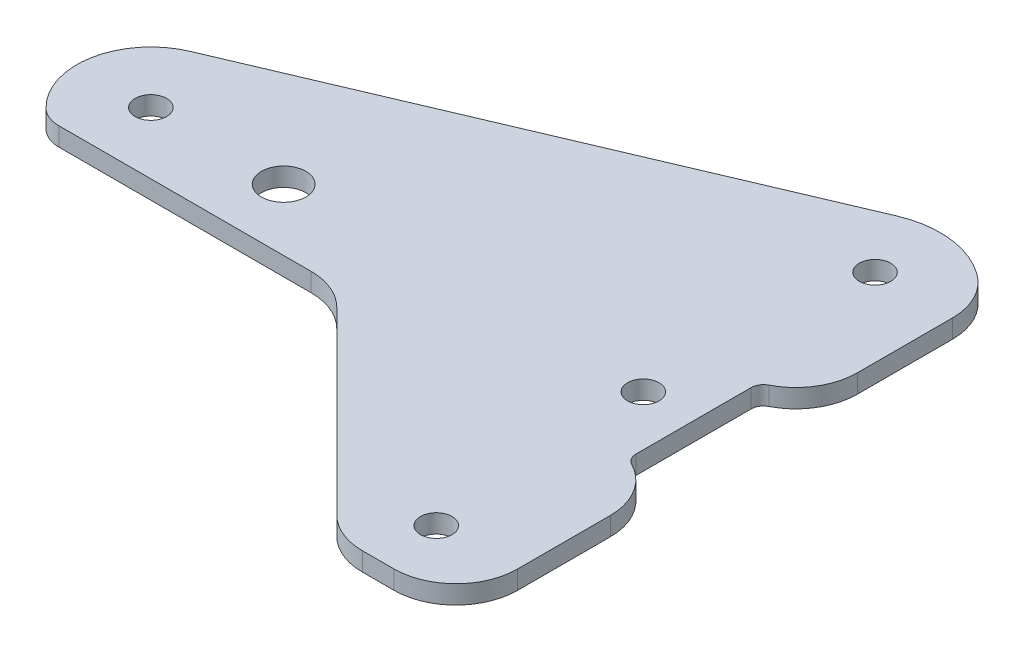
ISO-10303-21;
HEADER;
FILE_DESCRIPTION(('STEP AP214'),'2;1');
FILE_NAME('part.step','',(''),(''),'','','');
FILE_SCHEMA(('AUTOMOTIVE_DESIGN { 1 0 10303 214 1 1 1 1 }'));
ENDSEC;
DATA;
#1=APPLICATION_CONTEXT('core data for automotive mechanical design processes');
#2=APPLICATION_PROTOCOL_DEFINITION('international standard','automotive_design',2000,#1);
#3=PRODUCT_CONTEXT('',#1,'mechanical');
#4=PRODUCT('Part','Part','',(#3));
#5=PRODUCT_RELATED_PRODUCT_CATEGORY('part','',(#4));
#6=PRODUCT_DEFINITION_FORMATION('','',#4);
#7=PRODUCT_DEFINITION_CONTEXT('part definition',#1,'design');
#8=PRODUCT_DEFINITION('design','',#6,#7);
#9=PRODUCT_DEFINITION_SHAPE('','',#8);
#10=(LENGTH_UNIT() NAMED_UNIT(*) SI_UNIT(.MILLI.,.METRE.));
#11=(NAMED_UNIT(*) PLANE_ANGLE_UNIT() SI_UNIT($,.RADIAN.));
#12=(NAMED_UNIT(*) SI_UNIT($,.STERADIAN.) SOLID_ANGLE_UNIT());
#13=UNCERTAINTY_MEASURE_WITH_UNIT(LENGTH_MEASURE(1.E-05),#10,'distance_accuracy_value','');
#14=(GEOMETRIC_REPRESENTATION_CONTEXT(3) GLOBAL_UNCERTAINTY_ASSIGNED_CONTEXT((#13)) GLOBAL_UNIT_ASSIGNED_CONTEXT((#10,
#11,#12)) REPRESENTATION_CONTEXT('',''));
#15=CARTESIAN_POINT('',(0.,0.,0.));
#16=DIRECTION('',(0.,0.,1.));
#17=DIRECTION('',(1.,0.,0.));
#18=AXIS2_PLACEMENT_3D('',#15,#16,#17);
#19=CARTESIAN_POINT('',(243.548253692,70.6652182043,21.06693323164));
#20=DIRECTION('',(0.578405924452189,0.,-0.815749095346485));
#21=DIRECTION('',(-0.815749095346485,0.,-0.578405924452189));
#22=AXIS2_PLACEMENT_3D('',#19,#20,#21);
#23=PLANE('',#22);
#24=DIRECTION('',(0.,1.,0.));
#25=VECTOR('',#24,1.);
#26=CARTESIAN_POINT('',(218.489516869227,70.6652182043,3.29906573380305));
#27=LINE('',#26,#25);
#28=CARTESIAN_POINT('',(218.48951686925,70.6652182043,3.29906573382962));
#29=VERTEX_POINT('',#28);
#30=CARTESIAN_POINT('',(218.489516869488,67.6652182043,3.29906573399572));
#31=VERTEX_POINT('',#30);
#32=EDGE_CURVE('E301',#29,#31,#27,.F.);
#33=ORIENTED_EDGE('',*,*,#32,.F.);
#34=DIRECTION('',(-0.815749095346485,0.,-0.578405924452189));
#35=VECTOR('',#34,1.);
#36=CARTESIAN_POINT('',(243.548253692,70.6652182043,21.06693323164));
#37=LINE('',#36,#35);
#38=CARTESIAN_POINT('',(218.548253692011,70.6652182043,3.34071300805364));
#39=VERTEX_POINT('',#38);
#40=EDGE_CURVE('E196',#29,#39,#37,.F.);
#41=ORIENTED_EDGE('',*,*,#40,.T.);
#42=DIRECTION('',(0.,-1.,0.));
#43=VECTOR('',#42,1.);
#44=CARTESIAN_POINT('',(218.548253692006,70.6652182043,3.3407130080441));
#45=LINE('',#44,#43);
#46=CARTESIAN_POINT('',(218.54825369217,67.6652182043,3.3407130081649));
#47=VERTEX_POINT('',#46);
#48=EDGE_CURVE('E300',#47,#39,#45,.F.);
#49=ORIENTED_EDGE('',*,*,#48,.F.);
#50=DIRECTION('',(0.815749095324096,0.,0.578405924483765));
#51=VECTOR('',#50,1.);
#52=CARTESIAN_POINT('',(218.48951686922,67.6652182043,3.2990657338129));
#53=LINE('',#52,#51);
#54=EDGE_CURVE('E181',#31,#47,#53,.T.);
#55=ORIENTED_EDGE('',*,*,#54,.F.);
#56=EDGE_LOOP('',(#33,#41,#49,#55));
#57=FACE_BOUND('',#56,.T.);
#58=ADVANCED_FACE('F36',(#57),#23,.T.);
#59=CARTESIAN_POINT('',(123.5086322231,67.6652182043,51.87705587159));
#60=DIRECTION('',(0.,-1.,0.));
#61=DIRECTION('',(0.,0.,-1.));
#62=AXIS2_PLACEMENT_3D('',#59,#60,#61);
#63=PLANE('',#62);
#64=CARTESIAN_POINT('',(208.1076117087,67.6652182043,46.87705587159));
#65=DIRECTION('',(0.,1.,0.));
#66=DIRECTION('',(0.,0.,1.));
#67=AXIS2_PLACEMENT_3D('',#64,#65,#66);
#68=CIRCLE('',#67,2.54999999999999);
#69=CARTESIAN_POINT('',(208.1076117087,67.6652182043,49.42705587159));
#70=VERTEX_POINT('',#69);
#71=EDGE_CURVE('E219',#70,#70,#68,.T.);
#72=ORIENTED_EDGE('',*,*,#71,.T.);
#73=EDGE_LOOP('',(#72));
#74=FACE_BOUND('',#73,.T.);
#75=CARTESIAN_POINT('',(210.1,67.6652182043,82.37705587159));
#76=DIRECTION('',(0.,-1.,0.));
#77=DIRECTION('',(0.,0.,-1.));
#78=AXIS2_PLACEMENT_3D('',#75,#76,#77);
#79=CIRCLE('',#78,2.55);
#80=CARTESIAN_POINT('',(210.1,67.6652182043,79.82705587159));
#81=VERTEX_POINT('',#80);
#82=EDGE_CURVE('E273',#81,#81,#79,.F.);
#83=ORIENTED_EDGE('',*,*,#82,.T.);
#84=EDGE_LOOP('',(#83));
#85=FACE_BOUND('',#84,.T.);
#86=CARTESIAN_POINT('',(210.1,67.6652182043,11.37705587159));
#87=DIRECTION('',(0.,-1.,0.));
#88=DIRECTION('',(0.,0.,-1.));
#89=AXIS2_PLACEMENT_3D('',#86,#87,#88);
#90=CIRCLE('',#89,2.55);
#91=CARTESIAN_POINT('',(210.1,67.6652182043,8.82705587159));
#92=VERTEX_POINT('',#91);
#93=EDGE_CURVE('E276',#92,#92,#90,.F.);
#94=ORIENTED_EDGE('',*,*,#93,.T.);
#95=EDGE_LOOP('',(#94));
#96=FACE_BOUND('',#95,.T.);
#97=CARTESIAN_POINT('',(164.3506005389,67.6652182043,66.87705587159));
#98=DIRECTION('',(0.,1.,0.));
#99=DIRECTION('',(0.,0.,1.));
#100=AXIS2_PLACEMENT_3D('',#97,#98,#99);
#101=CIRCLE('',#100,10.);
#102=CARTESIAN_POINT('',(171.421668350768,67.6652182043,59.8059880597423));
#103=VERTEX_POINT('',#102);
#104=CARTESIAN_POINT('',(164.3506005389,67.6652182043,56.87705587159));
#105=VERTEX_POINT('',#104);
#106=EDGE_CURVE('E175',#103,#105,#101,.T.);
#107=ORIENTED_EDGE('',*,*,#106,.T.);
#108=DIRECTION('',(-1.,0.,0.));
#109=VECTOR('',#108,1.);
#110=CARTESIAN_POINT('',(186.,67.6652182043,56.87705587159));
#111=LINE('',#110,#109);
#112=CARTESIAN_POINT('',(123.5086322231,67.6652182043,56.87705587159));
#113=VERTEX_POINT('',#112);
#114=EDGE_CURVE('E169',#105,#113,#111,.T.);
#115=ORIENTED_EDGE('',*,*,#114,.T.);
#116=CARTESIAN_POINT('',(123.5086322231,67.6652182043,51.87705587159));
#117=DIRECTION('',(0.,-1.,0.));
#118=DIRECTION('',(0.,0.,-1.));
#119=AXIS2_PLACEMENT_3D('',#116,#117,#118);
#120=CIRCLE('',#119,5.);
#121=CARTESIAN_POINT('',(120.009361161997,67.6652182043,55.4484844430008));
#122=VERTEX_POINT('',#121);
#123=EDGE_CURVE('E39',#122,#113,#120,.F.);
#124=ORIENTED_EDGE('',*,*,#123,.F.);
#125=CARTESIAN_POINT('',(128.4076117087,67.6652182043,46.87705587159));
#126=DIRECTION('',(0.,1.,0.));
#127=DIRECTION('',(0.,0.,1.));
#128=AXIS2_PLACEMENT_3D('',#125,#126,#127);
#129=CIRCLE('',#128,12.);
#130=CARTESIAN_POINT('',(123.713460139609,67.6652182043,35.8332820126853));
#131=VERTEX_POINT('',#130);
#132=EDGE_CURVE('E164',#131,#122,#129,.T.);
#133=ORIENTED_EDGE('',*,*,#132,.F.);
#134=DIRECTION('',(-0.920314488241643,0.,0.391179297423218));
#135=VECTOR('',#134,1.);
#136=CARTESIAN_POINT('',(203.9457385411,67.6652182043,1.730584840413));
#137=LINE('',#136,#135);
#138=CARTESIAN_POINT('',(203.945738541126,67.6652182043,1.73058484041418));
#139=VERTEX_POINT('',#138);
#140=EDGE_CURVE('E220',#139,#131,#137,.T.);
#141=ORIENTED_EDGE('',*,*,#140,.F.);
#142=CARTESIAN_POINT('',(209.8134280025,67.6652182043,15.53530216404));
#143=DIRECTION('',(0.,1.,0.));
#144=DIRECTION('',(0.,0.,1.));
#145=AXIS2_PLACEMENT_3D('',#142,#143,#144);
#146=CIRCLE('',#145,15.);
#147=EDGE_CURVE('E302',#31,#139,#146,.T.);
#148=ORIENTED_EDGE('',*,*,#147,.F.);
#149=ORIENTED_EDGE('',*,*,#54,.T.);
#150=CARTESIAN_POINT('',(212.7641944475,67.6652182043,11.49820396152));
#151=DIRECTION('',(0.,-1.,0.));
#152=DIRECTION('',(0.,0.,-1.));
#153=AXIS2_PLACEMENT_3D('',#150,#151,#152);
#154=CIRCLE('',#153,10.);
#155=CARTESIAN_POINT('',(222.7641944475,67.6652182043,11.49820396152));
#156=VERTEX_POINT('',#155);
#157=EDGE_CURVE('E297',#156,#47,#154,.F.);
#158=ORIENTED_EDGE('',*,*,#157,.F.);
#159=DIRECTION('',(0.,0.,-1.));
#160=VECTOR('',#159,1.);
#161=CARTESIAN_POINT('',(222.7641944475,67.6652182043,46.01057575408));
#162=LINE('',#161,#160);
#163=CARTESIAN_POINT('',(222.7641944475,67.6652182043,26.87705587159));
#164=VERTEX_POINT('',#163);
#165=EDGE_CURVE('E213',#164,#156,#162,.T.);
#166=ORIENTED_EDGE('',*,*,#165,.F.);
#167=CARTESIAN_POINT('',(212.7641944475,67.6652182043,26.87705587159));
#168=DIRECTION('',(0.,1.,0.));
#169=DIRECTION('',(0.,0.,1.));
#170=AXIS2_PLACEMENT_3D('',#167,#168,#169);
#171=CIRCLE('',#170,10.);
#172=CARTESIAN_POINT('',(217.323870368322,67.6652182043,35.7770196634822));
#173=VERTEX_POINT('',#172);
#174=EDGE_CURVE('E216',#173,#164,#171,.T.);
#175=ORIENTED_EDGE('',*,*,#174,.F.);
#176=CARTESIAN_POINT('',(218.2358055525,67.6652182043,37.55701242185));
#177=DIRECTION('',(0.,1.,0.));
#178=DIRECTION('',(0.,0.,1.));
#179=AXIS2_PLACEMENT_3D('',#176,#177,#178);
#180=CIRCLE('',#179,2.);
#181=CARTESIAN_POINT('',(216.2358055525,67.6652182043,37.55701242185));
#182=VERTEX_POINT('',#181);
#183=EDGE_CURVE('E212',#173,#182,#180,.T.);
#184=ORIENTED_EDGE('',*,*,#183,.T.);
#185=DIRECTION('',(0.,0.,-1.));
#186=VECTOR('',#185,1.);
#187=CARTESIAN_POINT('',(216.2358055525,67.6652182043,57.49900083147));
#188=LINE('',#187,#186);
#189=CARTESIAN_POINT('',(216.2358055525,67.6652182043,56.19709932133));
#190=VERTEX_POINT('',#189);
#191=EDGE_CURVE('E209',#190,#182,#188,.T.);
#192=ORIENTED_EDGE('',*,*,#191,.F.);
#193=CARTESIAN_POINT('',(218.2358055525,67.6652182043,56.19709932133));
#194=DIRECTION('',(0.,-1.,0.));
#195=DIRECTION('',(0.,0.,-1.));
#196=AXIS2_PLACEMENT_3D('',#193,#194,#195);
#197=CIRCLE('',#196,2.);
#198=CARTESIAN_POINT('',(217.323870368324,67.6652182043,57.9770920796941));
#199=VERTEX_POINT('',#198);
#200=EDGE_CURVE('E288',#190,#199,#197,.F.);
#201=ORIENTED_EDGE('',*,*,#200,.T.);
#202=CARTESIAN_POINT('',(212.7641944475,67.6652182043,66.87705587159));
#203=DIRECTION('',(0.,-1.,0.));
#204=DIRECTION('',(0.,0.,-1.));
#205=AXIS2_PLACEMENT_3D('',#202,#203,#204);
#206=CIRCLE('',#205,9.99999999999999);
#207=CARTESIAN_POINT('',(222.7641944475,67.6652182043,66.87705587159));
#208=VERTEX_POINT('',#207);
#209=EDGE_CURVE('E286',#208,#199,#206,.F.);
#210=ORIENTED_EDGE('',*,*,#209,.F.);
#211=DIRECTION('',(0.,0.,-1.));
#212=VECTOR('',#211,1.);
#213=CARTESIAN_POINT('',(222.7641944475,67.6652182043,46.01057575408));
#214=LINE('',#213,#212);
#215=CARTESIAN_POINT('',(222.7641944475,67.6652182043,81.87705587159));
#216=VERTEX_POINT('',#215);
#217=EDGE_CURVE('E205',#216,#208,#214,.T.);
#218=ORIENTED_EDGE('',*,*,#217,.F.);
#219=CARTESIAN_POINT('',(212.7641944475,67.6652182043,81.87705587159));
#220=DIRECTION('',(0.,1.,0.));
#221=DIRECTION('',(0.,0.,1.));
#222=AXIS2_PLACEMENT_3D('',#219,#220,#221);
#223=CIRCLE('',#222,9.99999999999999);
#224=CARTESIAN_POINT('',(212.7641944475,67.6652182043,91.87705587159));
#225=VERTEX_POINT('',#224);
#226=EDGE_CURVE('E204',#225,#216,#223,.T.);
#227=ORIENTED_EDGE('',*,*,#226,.F.);
#228=DIRECTION('',(1.,0.,0.));
#229=VECTOR('',#228,1.);
#230=CARTESIAN_POINT('',(167.5857864376,67.6652182043,91.87705587159));
#231=LINE('',#230,#229);
#232=CARTESIAN_POINT('',(207.6348717864,67.6652182043,91.87705587159));
#233=VERTEX_POINT('',#232);
#234=EDGE_CURVE('E201',#233,#225,#231,.T.);
#235=ORIENTED_EDGE('',*,*,#234,.F.);
#236=CARTESIAN_POINT('',(207.6348717864,67.6652182043,81.87705587159));
#237=DIRECTION('',(0.,-1.,0.));
#238=DIRECTION('',(0.,0.,-1.));
#239=AXIS2_PLACEMENT_3D('',#236,#237,#238);
#240=CIRCLE('',#239,10.);
#241=CARTESIAN_POINT('',(200.563803974493,67.6652182043,88.9481236834825));
#242=VERTEX_POINT('',#241);
#243=EDGE_CURVE('E281',#242,#233,#240,.F.);
#244=ORIENTED_EDGE('',*,*,#243,.F.);
#245=DIRECTION('',(0.707106781186548,0.,0.707106781186548));
#246=VECTOR('',#245,1.);
#247=CARTESIAN_POINT('',(168.4927361626,67.6652182043,56.87705587159));
#248=LINE('',#247,#246);
#249=EDGE_CURVE('E197',#103,#242,#248,.T.);
#250=ORIENTED_EDGE('',*,*,#249,.F.);
#251=EDGE_LOOP('',(#107,#115,#124,#133,#141,#148,#149,#158,#166,#175,#184,#192,#201,#210,#218,
#227,#235,#244,#250));
#252=FACE_BOUND('',#251,.T.);
#253=CARTESIAN_POINT('',(149.9,67.6652182043,46.87705587159));
#254=DIRECTION('',(0.,-1.,0.));
#255=DIRECTION('',(0.,0.,-1.));
#256=AXIS2_PLACEMENT_3D('',#253,#254,#255);
#257=CIRCLE('',#256,3.59999999999999);
#258=CARTESIAN_POINT('',(149.9,67.6652182043,43.27705587159));
#259=VERTEX_POINT('',#258);
#260=EDGE_CURVE('E267',#259,#259,#257,.F.);
#261=ORIENTED_EDGE('',*,*,#260,.T.);
#262=EDGE_LOOP('',(#261));
#263=FACE_BOUND('',#262,.T.);
#264=CARTESIAN_POINT('',(128.4076117087,67.6652182043,46.87705587159));
#265=DIRECTION('',(0.,1.,0.));
#266=DIRECTION('',(0.,0.,1.));
#267=AXIS2_PLACEMENT_3D('',#264,#265,#266);
#268=CIRCLE('',#267,2.55);
#269=CARTESIAN_POINT('',(128.4076117087,67.6652182043,49.42705587159));
#270=VERTEX_POINT('',#269);
#271=EDGE_CURVE('E270',#270,#270,#268,.T.);
#272=ORIENTED_EDGE('',*,*,#271,.T.);
#273=EDGE_LOOP('',(#272));
#274=FACE_BOUND('',#273,.T.);
#275=ADVANCED_FACE('F171',(#74,#85,#96,#252,#263,#274),#63,.T.);
#276=CARTESIAN_POINT('',(186.,67.6652182043,56.87705587159));
#277=DIRECTION('',(0.,0.,-1.));
#278=DIRECTION('',(-1.,0.,0.));
#279=AXIS2_PLACEMENT_3D('',#276,#277,#278);
#280=PLANE('',#279);
#281=DIRECTION('',(1.,0.,0.));
#282=VECTOR('',#281,1.);
#283=CARTESIAN_POINT('',(225.5,70.6652182043,56.87705587159));
#284=LINE('',#283,#282);
#285=CARTESIAN_POINT('',(164.3506005389,70.6652182043,56.87705587159));
#286=VERTEX_POINT('',#285);
#287=CARTESIAN_POINT('',(123.5086322231,70.6652182043,56.87705587159));
#288=VERTEX_POINT('',#287);
#289=EDGE_CURVE('E190',#286,#288,#284,.F.);
#290=ORIENTED_EDGE('',*,*,#289,.T.);
#291=DIRECTION('',(0.,-1.,0.));
#292=VECTOR('',#291,1.);
#293=CARTESIAN_POINT('',(123.5086322231,76.9302182043,56.87705587159));
#294=LINE('',#293,#292);
#295=EDGE_CURVE('E180',#113,#288,#294,.F.);
#296=ORIENTED_EDGE('',*,*,#295,.F.);
#297=ORIENTED_EDGE('',*,*,#114,.F.);
#298=DIRECTION('',(0.,1.,0.));
#299=VECTOR('',#298,1.);
#300=CARTESIAN_POINT('',(164.3506005389,67.6652182043,56.87705587159));
#301=LINE('',#300,#299);
#302=EDGE_CURVE('E280',#105,#286,#301,.T.);
#303=ORIENTED_EDGE('',*,*,#302,.T.);
#304=EDGE_LOOP('',(#290,#296,#297,#303));
#305=FACE_BOUND('',#304,.T.);
#306=ADVANCED_FACE('F189',(#305),#280,.F.);
#307=CARTESIAN_POINT('',(123.5086322231,76.9302182043,51.87705587159));
#308=DIRECTION('',(0.,-1.,0.));
#309=DIRECTION('',(0.,0.,-1.));
#310=AXIS2_PLACEMENT_3D('',#307,#308,#309);
#311=CYLINDRICAL_SURFACE('',#310,5.);
#312=DIRECTION('',(0.,1.,0.));
#313=VECTOR('',#312,1.);
#314=CARTESIAN_POINT('',(120.009361162008,70.6652182043,55.4484844430119));
#315=LINE('',#314,#313);
#316=CARTESIAN_POINT('',(120.009361161997,70.6652182043,55.4484844430008));
#317=VERTEX_POINT('',#316);
#318=EDGE_CURVE('E187',#122,#317,#315,.T.);
#319=ORIENTED_EDGE('',*,*,#318,.F.);
#320=ORIENTED_EDGE('',*,*,#123,.T.);
#321=ORIENTED_EDGE('',*,*,#295,.T.);
#322=CARTESIAN_POINT('',(123.5086322231,70.6652182043,51.87705587159));
#323=DIRECTION('',(0.,-1.,0.));
#324=DIRECTION('',(0.,0.,-1.));
#325=AXIS2_PLACEMENT_3D('',#322,#323,#324);
#326=CIRCLE('',#325,5.);
#327=EDGE_CURVE('E265',#288,#317,#326,.T.);
#328=ORIENTED_EDGE('',*,*,#327,.T.);
#329=EDGE_LOOP('',(#319,#320,#321,#328));
#330=FACE_BOUND('',#329,.T.);
#331=ADVANCED_FACE('F184',(#330),#311,.T.);
#332=CARTESIAN_POINT('',(128.4076117087,70.6652182043,46.87705587159));
#333=DIRECTION('',(0.,1.,0.));
#334=DIRECTION('',(0.,0.,1.));
#335=AXIS2_PLACEMENT_3D('',#332,#333,#334);
#336=CYLINDRICAL_SURFACE('',#335,12.);
#337=ORIENTED_EDGE('',*,*,#132,.T.);
#338=ORIENTED_EDGE('',*,*,#318,.T.);
#339=CARTESIAN_POINT('',(128.4076117087,70.6652182043,46.87705587159));
#340=DIRECTION('',(0.,1.,0.));
#341=DIRECTION('',(0.,0.,1.));
#342=AXIS2_PLACEMENT_3D('',#339,#340,#341);
#343=CIRCLE('',#342,12.);
#344=CARTESIAN_POINT('',(123.713460139609,70.6652182043,35.8332820126857));
#345=VERTEX_POINT('',#344);
#346=EDGE_CURVE('E262',#317,#345,#343,.F.);
#347=ORIENTED_EDGE('',*,*,#346,.T.);
#348=DIRECTION('',(0.,1.,0.));
#349=VECTOR('',#348,1.);
#350=CARTESIAN_POINT('',(123.7134601396,70.6652182043,35.8332820126891));
#351=LINE('',#350,#349);
#352=EDGE_CURVE('E221',#131,#345,#351,.T.);
#353=ORIENTED_EDGE('',*,*,#352,.F.);
#354=EDGE_LOOP('',(#337,#338,#347,#353));
#355=FACE_BOUND('',#354,.T.);
#356=ADVANCED_FACE('F305',(#355),#336,.T.);
#357=CARTESIAN_POINT('',(203.9457385411,70.6652182043,1.730584840413));
#358=DIRECTION('',(-0.391179297423218,0.,-0.920314488241643));
#359=DIRECTION('',(-0.920314488241643,0.,0.391179297423218));
#360=AXIS2_PLACEMENT_3D('',#357,#358,#359);
#361=PLANE('',#360);
#362=ORIENTED_EDGE('',*,*,#352,.T.);
#363=DIRECTION('',(0.920314488241638,0.,-0.391179297423229));
#364=VECTOR('',#363,1.);
#365=CARTESIAN_POINT('',(123.7134601396,70.6652182043,35.83328201269));
#366=LINE('',#365,#364);
#367=CARTESIAN_POINT('',(203.945738541126,70.6652182043,1.73058484041421));
#368=VERTEX_POINT('',#367);
#369=EDGE_CURVE('E261',#345,#368,#366,.T.);
#370=ORIENTED_EDGE('',*,*,#369,.T.);
#371=DIRECTION('',(0.,1.,0.));
#372=VECTOR('',#371,1.);
#373=CARTESIAN_POINT('',(203.945738541109,70.6652182043,1.7305848404336));
#374=LINE('',#373,#372);
#375=EDGE_CURVE('E303',#139,#368,#374,.T.);
#376=ORIENTED_EDGE('',*,*,#375,.F.);
#377=ORIENTED_EDGE('',*,*,#140,.T.);
#378=EDGE_LOOP('',(#362,#370,#376,#377));
#379=FACE_BOUND('',#378,.T.);
#380=ADVANCED_FACE('F339',(#379),#361,.T.);
#381=CARTESIAN_POINT('',(209.8134280025,70.6652182043,15.53530216404));
#382=DIRECTION('',(0.,1.,0.));
#383=DIRECTION('',(0.,0.,1.));
#384=AXIS2_PLACEMENT_3D('',#381,#382,#383);
#385=CYLINDRICAL_SURFACE('',#384,15.);
#386=CARTESIAN_POINT('',(209.8134280025,70.6652182043,15.53530216404));
#387=DIRECTION('',(0.,1.,0.));
#388=DIRECTION('',(0.,0.,1.));
#389=AXIS2_PLACEMENT_3D('',#386,#387,#388);
#390=CIRCLE('',#389,15.);
#391=EDGE_CURVE('E259',#368,#29,#390,.F.);
#392=ORIENTED_EDGE('',*,*,#391,.T.);
#393=ORIENTED_EDGE('',*,*,#32,.T.);
#394=ORIENTED_EDGE('',*,*,#147,.T.);
#395=ORIENTED_EDGE('',*,*,#375,.T.);
#396=EDGE_LOOP('',(#392,#393,#394,#395));
#397=FACE_BOUND('',#396,.T.);
#398=ADVANCED_FACE('F343',(#397),#385,.T.);
#399=CARTESIAN_POINT('',(212.7641944475,70.6652182043,11.49820396152));
#400=DIRECTION('',(0.,-1.,0.));
#401=DIRECTION('',(0.,0.,-1.));
#402=AXIS2_PLACEMENT_3D('',#399,#400,#401);
#403=CYLINDRICAL_SURFACE('',#402,10.);
#404=ORIENTED_EDGE('',*,*,#48,.T.);
#405=CARTESIAN_POINT('',(212.7641944475,70.6652182043,11.49820396152));
#406=DIRECTION('',(0.,-1.,0.));
#407=DIRECTION('',(0.,0.,-1.));
#408=AXIS2_PLACEMENT_3D('',#405,#406,#407);
#409=CIRCLE('',#408,10.);
#410=CARTESIAN_POINT('',(222.7641944475,70.6652182043,11.49820396152));
#411=VERTEX_POINT('',#410);
#412=EDGE_CURVE('E256',#39,#411,#409,.T.);
#413=ORIENTED_EDGE('',*,*,#412,.T.);
#414=DIRECTION('',(0.,1.,0.));
#415=VECTOR('',#414,1.);
#416=CARTESIAN_POINT('',(222.7641944475,69.4152182043,11.49820396152));
#417=LINE('',#416,#415);
#418=EDGE_CURVE('E217',#156,#411,#417,.T.);
#419=ORIENTED_EDGE('',*,*,#418,.F.);
#420=ORIENTED_EDGE('',*,*,#157,.T.);
#421=EDGE_LOOP('',(#404,#413,#419,#420));
#422=FACE_BOUND('',#421,.T.);
#423=ADVANCED_FACE('F349',(#422),#403,.T.);
#424=CARTESIAN_POINT('',(222.7641944475,69.4152182043,46.01057575408));
#425=DIRECTION('',(1.,0.,0.));
#426=DIRECTION('',(0.,0.,-1.));
#427=AXIS2_PLACEMENT_3D('',#424,#425,#426);
#428=PLANE('',#427);
#429=DIRECTION('',(0.,1.,0.));
#430=VECTOR('',#429,1.);
#431=CARTESIAN_POINT('',(222.7641944475,69.4152182043,26.87705587159));
#432=LINE('',#431,#430);
#433=CARTESIAN_POINT('',(222.7641944475,70.6652182043,26.87705587159));
#434=VERTEX_POINT('',#433);
#435=EDGE_CURVE('E296',#164,#434,#432,.T.);
#436=ORIENTED_EDGE('',*,*,#435,.F.);
#437=ORIENTED_EDGE('',*,*,#165,.T.);
#438=ORIENTED_EDGE('',*,*,#418,.T.);
#439=DIRECTION('',(0.,0.,-1.));
#440=VECTOR('',#439,1.);
#441=CARTESIAN_POINT('',(222.7641944475,70.6652182043,46.87705587159));
#442=LINE('',#441,#440);
#443=EDGE_CURVE('E255',#411,#434,#442,.F.);
#444=ORIENTED_EDGE('',*,*,#443,.T.);
#445=EDGE_LOOP('',(#436,#437,#438,#444));
#446=FACE_BOUND('',#445,.T.);
#447=ADVANCED_FACE('F357',(#446),#428,.T.);
#448=CARTESIAN_POINT('',(212.7641944475,69.4152182043,26.87705587159));
#449=DIRECTION('',(0.,1.,0.));
#450=DIRECTION('',(0.,0.,1.));
#451=AXIS2_PLACEMENT_3D('',#448,#449,#450);
#452=CYLINDRICAL_SURFACE('',#451,10.);
#453=ORIENTED_EDGE('',*,*,#435,.T.);
#454=CARTESIAN_POINT('',(212.7641944475,70.6652182043,26.87705587159));
#455=DIRECTION('',(0.,1.,0.));
#456=DIRECTION('',(0.,0.,1.));
#457=AXIS2_PLACEMENT_3D('',#454,#455,#456);
#458=CIRCLE('',#457,10.);
#459=CARTESIAN_POINT('',(217.32387036832,70.6652182043,35.7770196634785));
#460=VERTEX_POINT('',#459);
#461=EDGE_CURVE('E252',#434,#460,#458,.F.);
#462=ORIENTED_EDGE('',*,*,#461,.T.);
#463=DIRECTION('',(0.,1.,0.));
#464=VECTOR('',#463,1.);
#465=CARTESIAN_POINT('',(217.323870368308,64.9062182043,35.7770196634849));
#466=LINE('',#465,#464);
#467=EDGE_CURVE('E294',#460,#173,#466,.F.);
#468=ORIENTED_EDGE('',*,*,#467,.T.);
#469=ORIENTED_EDGE('',*,*,#174,.T.);
#470=EDGE_LOOP('',(#453,#462,#468,#469));
#471=FACE_BOUND('',#470,.T.);
#472=ADVANCED_FACE('F364',(#471),#452,.T.);
#473=CARTESIAN_POINT('',(218.2358055525,64.9062182043,37.55701242185));
#474=DIRECTION('',(0.,1.,0.));
#475=DIRECTION('',(0.,0.,1.));
#476=AXIS2_PLACEMENT_3D('',#473,#474,#475);
#477=CYLINDRICAL_SURFACE('',#476,2.);
#478=DIRECTION('',(0.,1.,0.));
#479=VECTOR('',#478,1.);
#480=CARTESIAN_POINT('',(216.2358055525,70.6652182043,37.55701242185));
#481=LINE('',#480,#479);
#482=CARTESIAN_POINT('',(216.2358055525,70.6652182043,37.55701242185));
#483=VERTEX_POINT('',#482);
#484=EDGE_CURVE('E211',#182,#483,#481,.T.);
#485=ORIENTED_EDGE('',*,*,#484,.F.);
#486=ORIENTED_EDGE('',*,*,#183,.F.);
#487=ORIENTED_EDGE('',*,*,#467,.F.);
#488=CARTESIAN_POINT('',(218.2358055525,70.6652182043,37.55701242185));
#489=DIRECTION('',(0.,1.,0.));
#490=DIRECTION('',(0.,0.,1.));
#491=AXIS2_PLACEMENT_3D('',#488,#489,#490);
#492=CIRCLE('',#491,2.);
#493=EDGE_CURVE('E249',#460,#483,#492,.T.);
#494=ORIENTED_EDGE('',*,*,#493,.T.);
#495=EDGE_LOOP('',(#485,#486,#487,#494));
#496=FACE_BOUND('',#495,.T.);
#497=ADVANCED_FACE('F363',(#496),#477,.F.);
#498=CARTESIAN_POINT('',(216.2358055525,70.6652182043,57.49900083147));
#499=DIRECTION('',(1.,0.,0.));
#500=DIRECTION('',(0.,0.,-1.));
#501=AXIS2_PLACEMENT_3D('',#498,#499,#500);
#502=PLANE('',#501);
#503=ORIENTED_EDGE('',*,*,#484,.T.);
#504=DIRECTION('',(0.,0.,-1.));
#505=VECTOR('',#504,1.);
#506=CARTESIAN_POINT('',(216.2358055525,70.6652182043,46.87705587159));
#507=LINE('',#506,#505);
#508=CARTESIAN_POINT('',(216.2358055525,70.6652182043,56.19709932133));
#509=VERTEX_POINT('',#508);
#510=EDGE_CURVE('E248',#483,#509,#507,.F.);
#511=ORIENTED_EDGE('',*,*,#510,.T.);
#512=DIRECTION('',(0.,-1.,0.));
#513=VECTOR('',#512,1.);
#514=CARTESIAN_POINT('',(216.2358055525,73.9242182043,56.19709932133));
#515=LINE('',#514,#513);
#516=EDGE_CURVE('E291',#509,#190,#515,.T.);
#517=ORIENTED_EDGE('',*,*,#516,.T.);
#518=ORIENTED_EDGE('',*,*,#191,.T.);
#519=EDGE_LOOP('',(#503,#511,#517,#518));
#520=FACE_BOUND('',#519,.T.);
#521=ADVANCED_FACE('F371',(#520),#502,.T.);
#522=CARTESIAN_POINT('',(218.2358055525,73.9242182043,56.19709932133));
#523=DIRECTION('',(0.,-1.,0.));
#524=DIRECTION('',(0.,0.,-1.));
#525=AXIS2_PLACEMENT_3D('',#522,#523,#524);
#526=CYLINDRICAL_SURFACE('',#525,2.);
#527=ORIENTED_EDGE('',*,*,#200,.F.);
#528=ORIENTED_EDGE('',*,*,#516,.F.);
#529=CARTESIAN_POINT('',(218.2358055525,70.6652182043,56.19709932133));
#530=DIRECTION('',(0.,-1.,0.));
#531=DIRECTION('',(0.,0.,-1.));
#532=AXIS2_PLACEMENT_3D('',#529,#530,#531);
#533=CIRCLE('',#532,2.);
#534=CARTESIAN_POINT('',(217.323870368324,70.6652182043,57.9770920796941));
#535=VERTEX_POINT('',#534);
#536=EDGE_CURVE('E245',#509,#535,#533,.F.);
#537=ORIENTED_EDGE('',*,*,#536,.T.);
#538=DIRECTION('',(0.,-1.,0.));
#539=VECTOR('',#538,1.);
#540=CARTESIAN_POINT('',(217.323870368311,69.4152182043,57.9770920796877));
#541=LINE('',#540,#539);
#542=EDGE_CURVE('E208',#199,#535,#541,.F.);
#543=ORIENTED_EDGE('',*,*,#542,.F.);
#544=EDGE_LOOP('',(#527,#528,#537,#543));
#545=FACE_BOUND('',#544,.T.);
#546=ADVANCED_FACE('F428',(#545),#526,.F.);
#547=CARTESIAN_POINT('',(212.7641944475,69.4152182043,66.87705587159));
#548=DIRECTION('',(0.,-1.,0.));
#549=DIRECTION('',(0.,0.,-1.));
#550=AXIS2_PLACEMENT_3D('',#547,#548,#549);
#551=CYLINDRICAL_SURFACE('',#550,9.99999999999999);
#552=ORIENTED_EDGE('',*,*,#209,.T.);
#553=ORIENTED_EDGE('',*,*,#542,.T.);
#554=CARTESIAN_POINT('',(212.7641944475,70.6652182043,66.87705587159));
#555=DIRECTION('',(0.,-1.,0.));
#556=DIRECTION('',(0.,0.,-1.));
#557=AXIS2_PLACEMENT_3D('',#554,#555,#556);
#558=CIRCLE('',#557,9.99999999999999);
#559=CARTESIAN_POINT('',(222.7641944475,70.6652182043,66.87705587159));
#560=VERTEX_POINT('',#559);
#561=EDGE_CURVE('E242',#535,#560,#558,.T.);
#562=ORIENTED_EDGE('',*,*,#561,.T.);
#563=DIRECTION('',(0.,1.,0.));
#564=VECTOR('',#563,1.);
#565=CARTESIAN_POINT('',(222.7641944475,69.4152182043,66.87705587159));
#566=LINE('',#565,#564);
#567=EDGE_CURVE('E207',#208,#560,#566,.T.);
#568=ORIENTED_EDGE('',*,*,#567,.F.);
#569=EDGE_LOOP('',(#552,#553,#562,#568));
#570=FACE_BOUND('',#569,.T.);
#571=ADVANCED_FACE('F424',(#570),#551,.T.);
#572=CARTESIAN_POINT('',(222.7641944475,69.4152182043,46.01057575408));
#573=DIRECTION('',(1.,0.,0.));
#574=DIRECTION('',(0.,0.,-1.));
#575=AXIS2_PLACEMENT_3D('',#572,#573,#574);
#576=PLANE('',#575);
#577=ORIENTED_EDGE('',*,*,#567,.T.);
#578=DIRECTION('',(0.,0.,-1.));
#579=VECTOR('',#578,1.);
#580=CARTESIAN_POINT('',(222.7641944475,70.6652182043,46.87705587159));
#581=LINE('',#580,#579);
#582=CARTESIAN_POINT('',(222.7641944475,70.6652182043,81.87705587159));
#583=VERTEX_POINT('',#582);
#584=EDGE_CURVE('E241',#560,#583,#581,.F.);
#585=ORIENTED_EDGE('',*,*,#584,.T.);
#586=DIRECTION('',(0.,1.,0.));
#587=VECTOR('',#586,1.);
#588=CARTESIAN_POINT('',(222.7641944475,69.4152182043,81.87705587159));
#589=LINE('',#588,#587);
#590=EDGE_CURVE('E285',#216,#583,#589,.T.);
#591=ORIENTED_EDGE('',*,*,#590,.F.);
#592=ORIENTED_EDGE('',*,*,#217,.T.);
#593=EDGE_LOOP('',(#577,#585,#591,#592));
#594=FACE_BOUND('',#593,.T.);
#595=ADVANCED_FACE('F420',(#594),#576,.T.);
#596=CARTESIAN_POINT('',(212.7641944475,69.4152182043,81.87705587159));
#597=DIRECTION('',(0.,1.,0.));
#598=DIRECTION('',(0.,0.,1.));
#599=AXIS2_PLACEMENT_3D('',#596,#597,#598);
#600=CYLINDRICAL_SURFACE('',#599,9.99999999999999);
#601=DIRECTION('',(0.,1.,0.));
#602=VECTOR('',#601,1.);
#603=CARTESIAN_POINT('',(212.7641944475,69.4152182043,91.87705587159));
#604=LINE('',#603,#602);
#605=CARTESIAN_POINT('',(212.7641944475,70.6652182043,91.87705587159));
#606=VERTEX_POINT('',#605);
#607=EDGE_CURVE('E203',#225,#606,#604,.T.);
#608=ORIENTED_EDGE('',*,*,#607,.F.);
#609=ORIENTED_EDGE('',*,*,#226,.T.);
#610=ORIENTED_EDGE('',*,*,#590,.T.);
#611=CARTESIAN_POINT('',(212.7641944475,70.6652182043,81.87705587159));
#612=DIRECTION('',(0.,1.,0.));
#613=DIRECTION('',(0.,0.,1.));
#614=AXIS2_PLACEMENT_3D('',#611,#612,#613);
#615=CIRCLE('',#614,9.99999999999999);
#616=EDGE_CURVE('E238',#583,#606,#615,.F.);
#617=ORIENTED_EDGE('',*,*,#616,.T.);
#618=EDGE_LOOP('',(#608,#609,#610,#617));
#619=FACE_BOUND('',#618,.T.);
#620=ADVANCED_FACE('F416',(#619),#600,.T.);
#621=CARTESIAN_POINT('',(167.5857864376,69.4152182043,91.87705587159));
#622=DIRECTION('',(0.,0.,1.));
#623=DIRECTION('',(1.,0.,0.));
#624=AXIS2_PLACEMENT_3D('',#621,#622,#623);
#625=PLANE('',#624);
#626=ORIENTED_EDGE('',*,*,#607,.T.);
#627=DIRECTION('',(1.,0.,0.));
#628=VECTOR('',#627,1.);
#629=CARTESIAN_POINT('',(225.5,70.6652182043,91.87705587159));
#630=LINE('',#629,#628);
#631=CARTESIAN_POINT('',(207.6348717864,70.6652182043,91.87705587159));
#632=VERTEX_POINT('',#631);
#633=EDGE_CURVE('E237',#606,#632,#630,.F.);
#634=ORIENTED_EDGE('',*,*,#633,.T.);
#635=DIRECTION('',(0.,-1.,0.));
#636=VECTOR('',#635,1.);
#637=CARTESIAN_POINT('',(207.6348717864,69.4152182043,91.87705587159));
#638=LINE('',#637,#636);
#639=EDGE_CURVE('E199',#233,#632,#638,.F.);
#640=ORIENTED_EDGE('',*,*,#639,.F.);
#641=ORIENTED_EDGE('',*,*,#234,.T.);
#642=EDGE_LOOP('',(#626,#634,#640,#641));
#643=FACE_BOUND('',#642,.T.);
#644=ADVANCED_FACE('F412',(#643),#625,.T.);
#645=CARTESIAN_POINT('',(207.6348717864,69.4152182043,81.87705587159));
#646=DIRECTION('',(0.,-1.,0.));
#647=DIRECTION('',(0.,0.,-1.));
#648=AXIS2_PLACEMENT_3D('',#645,#646,#647);
#649=CYLINDRICAL_SURFACE('',#648,10.);
#650=ORIENTED_EDGE('',*,*,#639,.T.);
#651=CARTESIAN_POINT('',(207.6348717864,70.6652182043,81.87705587159));
#652=DIRECTION('',(0.,-1.,0.));
#653=DIRECTION('',(0.,0.,-1.));
#654=AXIS2_PLACEMENT_3D('',#651,#652,#653);
#655=CIRCLE('',#654,10.);
#656=CARTESIAN_POINT('',(200.563803974498,70.6652182043,88.9481236834732));
#657=VERTEX_POINT('',#656);
#658=EDGE_CURVE('E234',#632,#657,#655,.T.);
#659=ORIENTED_EDGE('',*,*,#658,.T.);
#660=DIRECTION('',(0.,1.,0.));
#661=VECTOR('',#660,1.);
#662=CARTESIAN_POINT('',(200.563803974485,67.6652182043,88.948123683475));
#663=LINE('',#662,#661);
#664=EDGE_CURVE('E198',#242,#657,#663,.T.);
#665=ORIENTED_EDGE('',*,*,#664,.F.);
#666=ORIENTED_EDGE('',*,*,#243,.T.);
#667=EDGE_LOOP('',(#650,#659,#665,#666));
#668=FACE_BOUND('',#667,.T.);
#669=ADVANCED_FACE('F408',(#668),#649,.T.);
#670=CARTESIAN_POINT('',(168.4927361626,67.6652182043,56.87705587159));
#671=DIRECTION('',(-0.707106781186548,0.,0.707106781186548));
#672=DIRECTION('',(0.707106781186548,0.,0.707106781186548));
#673=AXIS2_PLACEMENT_3D('',#670,#671,#672);
#674=PLANE('',#673);
#675=ORIENTED_EDGE('',*,*,#664,.T.);
#676=DIRECTION('',(-0.707106781186183,0.,-0.707106781186912));
#677=VECTOR('',#676,1.);
#678=CARTESIAN_POINT('',(200.5638039745,70.6652182043,88.94812368346));
#679=LINE('',#678,#677);
#680=CARTESIAN_POINT('',(171.421668350785,70.6652182043,59.8059880597291));
#681=VERTEX_POINT('',#680);
#682=EDGE_CURVE('E233',#657,#681,#679,.T.);
#683=ORIENTED_EDGE('',*,*,#682,.T.);
#684=DIRECTION('',(0.,1.,0.));
#685=VECTOR('',#684,1.);
#686=CARTESIAN_POINT('',(171.421668350785,67.6652182043,59.8059880597445));
#687=LINE('',#686,#685);
#688=EDGE_CURVE('E54',#681,#103,#687,.F.);
#689=ORIENTED_EDGE('',*,*,#688,.T.);
#690=ORIENTED_EDGE('',*,*,#249,.T.);
#691=EDGE_LOOP('',(#675,#683,#689,#690));
#692=FACE_BOUND('',#691,.T.);
#693=ADVANCED_FACE('F405',(#692),#674,.T.);
#694=CARTESIAN_POINT('',(164.3506005389,67.6652182043,66.87705587159));
#695=DIRECTION('',(0.,1.,0.));
#696=DIRECTION('',(0.,0.,1.));
#697=AXIS2_PLACEMENT_3D('',#694,#695,#696);
#698=CYLINDRICAL_SURFACE('',#697,10.);
#699=CARTESIAN_POINT('',(164.3506005389,70.6652182043,66.87705587159));
#700=DIRECTION('',(0.,1.,0.));
#701=DIRECTION('',(0.,0.,1.));
#702=AXIS2_PLACEMENT_3D('',#699,#700,#701);
#703=CIRCLE('',#702,10.);
#704=EDGE_CURVE('E231',#681,#286,#703,.T.);
#705=ORIENTED_EDGE('',*,*,#704,.T.);
#706=ORIENTED_EDGE('',*,*,#302,.F.);
#707=ORIENTED_EDGE('',*,*,#106,.F.);
#708=ORIENTED_EDGE('',*,*,#688,.F.);
#709=EDGE_LOOP('',(#705,#706,#707,#708));
#710=FACE_BOUND('',#709,.T.);
#711=ADVANCED_FACE('F401',(#710),#698,.F.);
#712=CARTESIAN_POINT('',(210.1,70.6652182043,11.37705587159));
#713=DIRECTION('',(0.,-1.,0.));
#714=DIRECTION('',(0.,0.,-1.));
#715=AXIS2_PLACEMENT_3D('',#712,#713,#714);
#716=CYLINDRICAL_SURFACE('',#715,2.55);
#717=CARTESIAN_POINT('',(210.1,70.6652182043,11.37705587159));
#718=DIRECTION('',(0.,-1.,0.));
#719=DIRECTION('',(0.,0.,-1.));
#720=AXIS2_PLACEMENT_3D('',#717,#718,#719);
#721=CIRCLE('',#720,2.55);
#722=CARTESIAN_POINT('',(210.1,70.6652182043,8.82705587159));
#723=VERTEX_POINT('',#722);
#724=EDGE_CURVE('E228',#723,#723,#721,.F.);
#725=ORIENTED_EDGE('',*,*,#724,.T.);
#726=EDGE_LOOP('',(#725));
#727=FACE_BOUND('',#726,.T.);
#728=ORIENTED_EDGE('',*,*,#93,.F.);
#729=EDGE_LOOP('',(#728));
#730=FACE_BOUND('',#729,.T.);
#731=ADVANCED_FACE('F397',(#727,#730),#716,.F.);
#732=CARTESIAN_POINT('',(210.1,70.6652182043,82.37705587159));
#733=DIRECTION('',(0.,-1.,0.));
#734=DIRECTION('',(0.,0.,-1.));
#735=AXIS2_PLACEMENT_3D('',#732,#733,#734);
#736=CYLINDRICAL_SURFACE('',#735,2.55);
#737=CARTESIAN_POINT('',(210.1,70.6652182043,82.37705587159));
#738=DIRECTION('',(0.,-1.,0.));
#739=DIRECTION('',(0.,0.,-1.));
#740=AXIS2_PLACEMENT_3D('',#737,#738,#739);
#741=CIRCLE('',#740,2.55);
#742=CARTESIAN_POINT('',(210.1,70.6652182043,79.82705587159));
#743=VERTEX_POINT('',#742);
#744=EDGE_CURVE('E225',#743,#743,#741,.F.);
#745=ORIENTED_EDGE('',*,*,#744,.T.);
#746=EDGE_LOOP('',(#745));
#747=FACE_BOUND('',#746,.T.);
#748=ORIENTED_EDGE('',*,*,#82,.F.);
#749=EDGE_LOOP('',(#748));
#750=FACE_BOUND('',#749,.T.);
#751=ADVANCED_FACE('F393',(#747,#750),#736,.F.);
#752=CARTESIAN_POINT('',(128.4076117087,70.6652182043,46.87705587159));
#753=DIRECTION('',(0.,1.,0.));
#754=DIRECTION('',(0.,0.,1.));
#755=AXIS2_PLACEMENT_3D('',#752,#753,#754);
#756=CYLINDRICAL_SURFACE('',#755,2.55);
#757=ORIENTED_EDGE('',*,*,#271,.F.);
#758=EDGE_LOOP('',(#757));
#759=FACE_BOUND('',#758,.T.);
#760=CARTESIAN_POINT('',(128.4076117087,70.6652182043,46.87705587159));
#761=DIRECTION('',(0.,1.,0.));
#762=DIRECTION('',(0.,0.,1.));
#763=AXIS2_PLACEMENT_3D('',#760,#761,#762);
#764=CIRCLE('',#763,2.55);
#765=CARTESIAN_POINT('',(128.4076117087,70.6652182043,49.42705587159));
#766=VERTEX_POINT('',#765);
#767=EDGE_CURVE('E45',#766,#766,#764,.T.);
#768=ORIENTED_EDGE('',*,*,#767,.T.);
#769=EDGE_LOOP('',(#768));
#770=FACE_BOUND('',#769,.T.);
#771=ADVANCED_FACE('F385',(#759,#770),#756,.F.);
#772=CARTESIAN_POINT('',(149.9,68.1652182043,46.87705587159));
#773=DIRECTION('',(0.,-1.,0.));
#774=DIRECTION('',(0.,0.,-1.));
#775=AXIS2_PLACEMENT_3D('',#772,#773,#774);
#776=CYLINDRICAL_SURFACE('',#775,3.59999999999999);
#777=CARTESIAN_POINT('',(149.9,70.6652182043,46.87705587159));
#778=DIRECTION('',(0.,-1.,0.));
#779=DIRECTION('',(0.,0.,-1.));
#780=AXIS2_PLACEMENT_3D('',#777,#778,#779);
#781=CIRCLE('',#780,3.59999999999999);
#782=CARTESIAN_POINT('',(149.9,70.6652182043,43.27705587159));
#783=VERTEX_POINT('',#782);
#784=EDGE_CURVE('E11',#783,#783,#781,.F.);
#785=ORIENTED_EDGE('',*,*,#784,.T.);
#786=EDGE_LOOP('',(#785));
#787=FACE_BOUND('',#786,.T.);
#788=ORIENTED_EDGE('',*,*,#260,.F.);
#789=EDGE_LOOP('',(#788));
#790=FACE_BOUND('',#789,.T.);
#791=ADVANCED_FACE('F376',(#787,#790),#776,.F.);
#792=CARTESIAN_POINT('',(225.5,70.6652182043,46.87705587159));
#793=DIRECTION('',(0.,-1.,0.));
#794=DIRECTION('',(0.,0.,-1.));
#795=AXIS2_PLACEMENT_3D('',#792,#793,#794);
#796=PLANE('',#795);
#797=CARTESIAN_POINT('',(208.1076117087,70.6652182043,46.87705587159));
#798=DIRECTION('',(0.,1.,0.));
#799=DIRECTION('',(0.,0.,1.));
#800=AXIS2_PLACEMENT_3D('',#797,#798,#799);
#801=CIRCLE('',#800,2.54999999999999);
#802=CARTESIAN_POINT('',(208.1076117087,70.6652182043,49.42705587159));
#803=VERTEX_POINT('',#802);
#804=EDGE_CURVE('E448',#803,#803,#801,.T.);
#805=ORIENTED_EDGE('',*,*,#804,.F.);
#806=EDGE_LOOP('',(#805));
#807=FACE_BOUND('',#806,.T.);
#808=ORIENTED_EDGE('',*,*,#784,.F.);
#809=EDGE_LOOP('',(#808));
#810=FACE_BOUND('',#809,.T.);
#811=ORIENTED_EDGE('',*,*,#767,.F.);
#812=EDGE_LOOP('',(#811));
#813=FACE_BOUND('',#812,.T.);
#814=ORIENTED_EDGE('',*,*,#744,.F.);
#815=EDGE_LOOP('',(#814));
#816=FACE_BOUND('',#815,.T.);
#817=ORIENTED_EDGE('',*,*,#724,.F.);
#818=EDGE_LOOP('',(#817));
#819=FACE_BOUND('',#818,.T.);
#820=ORIENTED_EDGE('',*,*,#682,.F.);
#821=ORIENTED_EDGE('',*,*,#658,.F.);
#822=ORIENTED_EDGE('',*,*,#633,.F.);
#823=ORIENTED_EDGE('',*,*,#616,.F.);
#824=ORIENTED_EDGE('',*,*,#584,.F.);
#825=ORIENTED_EDGE('',*,*,#561,.F.);
#826=ORIENTED_EDGE('',*,*,#536,.F.);
#827=ORIENTED_EDGE('',*,*,#510,.F.);
#828=ORIENTED_EDGE('',*,*,#493,.F.);
#829=ORIENTED_EDGE('',*,*,#461,.F.);
#830=ORIENTED_EDGE('',*,*,#443,.F.);
#831=ORIENTED_EDGE('',*,*,#412,.F.);
#832=ORIENTED_EDGE('',*,*,#40,.F.);
#833=ORIENTED_EDGE('',*,*,#391,.F.);
#834=ORIENTED_EDGE('',*,*,#369,.F.);
#835=ORIENTED_EDGE('',*,*,#346,.F.);
#836=ORIENTED_EDGE('',*,*,#327,.F.);
#837=ORIENTED_EDGE('',*,*,#289,.F.);
#838=ORIENTED_EDGE('',*,*,#704,.F.);
#839=EDGE_LOOP('',(#820,#821,#822,#823,#824,#825,#826,#827,#828,#829,#830,#831,#832,#833,#834,
#835,#836,#837,#838));
#840=FACE_BOUND('',#839,.T.);
#841=ADVANCED_FACE('F309',(#807,#810,#813,#816,#819,#840),#796,.F.);
#842=CARTESIAN_POINT('',(208.1076117087,67.6652182043,46.87705587159));
#843=DIRECTION('',(0.,1.,0.));
#844=DIRECTION('',(0.,0.,1.));
#845=AXIS2_PLACEMENT_3D('',#842,#843,#844);
#846=CYLINDRICAL_SURFACE('',#845,2.54999999999999);
#847=ORIENTED_EDGE('',*,*,#71,.F.);
#848=EDGE_LOOP('',(#847));
#849=FACE_BOUND('',#848,.T.);
#850=ORIENTED_EDGE('',*,*,#804,.T.);
#851=EDGE_LOOP('',(#850));
#852=FACE_BOUND('',#851,.T.);
#853=ADVANCED_FACE('F375',(#849,#852),#846,.F.);
#854=CLOSED_SHELL('',(#58,#275,#306,#331,#356,#380,#398,#423,#447,#472,#497,#521,#546,#571,#595,
#620,#644,#669,#693,#711,#731,#751,#771,#791,#841,#853));
#855=MANIFOLD_SOLID_BREP('B2',#854);
#856=ADVANCED_BREP_SHAPE_REPRESENTATION('',(#18,#855),#14);
#857=SHAPE_DEFINITION_REPRESENTATION(#9,#856);
ENDSEC;
END-ISO-10303-21;
